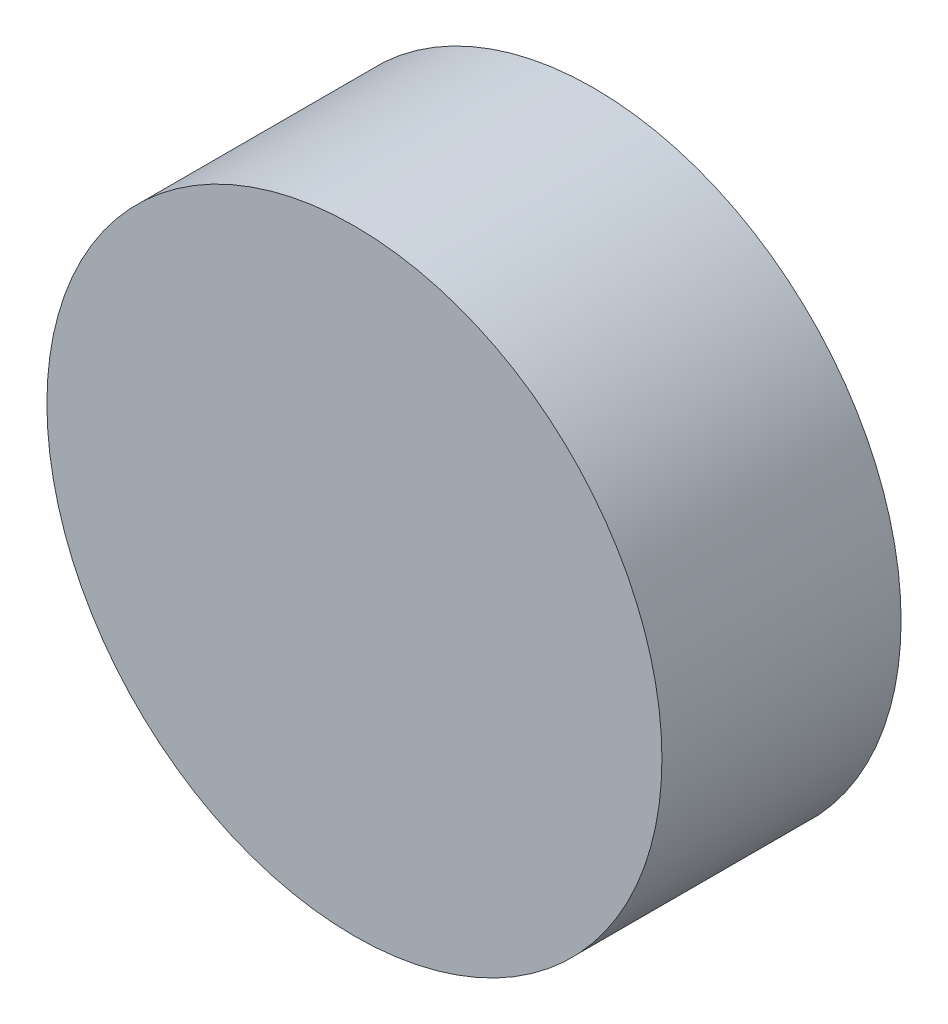
ISO-10303-21;
HEADER;
FILE_DESCRIPTION(('STEP AP214'),'2;1');
FILE_NAME('part.step','',(''),(''),'','','');
FILE_SCHEMA(('AUTOMOTIVE_DESIGN { 1 0 10303 214 1 1 1 1 }'));
ENDSEC;
DATA;
#1=APPLICATION_CONTEXT('core data for automotive mechanical design processes');
#2=APPLICATION_PROTOCOL_DEFINITION('international standard','automotive_design',2000,#1);
#3=PRODUCT_CONTEXT('',#1,'mechanical');
#4=PRODUCT('Part','Part','',(#3));
#5=PRODUCT_RELATED_PRODUCT_CATEGORY('part','',(#4));
#6=PRODUCT_DEFINITION_FORMATION('','',#4);
#7=PRODUCT_DEFINITION_CONTEXT('part definition',#1,'design');
#8=PRODUCT_DEFINITION('design','',#6,#7);
#9=PRODUCT_DEFINITION_SHAPE('','',#8);
#10=(LENGTH_UNIT() NAMED_UNIT(*) SI_UNIT(.MILLI.,.METRE.));
#11=(NAMED_UNIT(*) PLANE_ANGLE_UNIT() SI_UNIT($,.RADIAN.));
#12=(NAMED_UNIT(*) SI_UNIT($,.STERADIAN.) SOLID_ANGLE_UNIT());
#13=UNCERTAINTY_MEASURE_WITH_UNIT(LENGTH_MEASURE(1.E-05),#10,'distance_accuracy_value','');
#14=(GEOMETRIC_REPRESENTATION_CONTEXT(3) GLOBAL_UNCERTAINTY_ASSIGNED_CONTEXT((#13)) GLOBAL_UNIT_ASSIGNED_CONTEXT((#10,
#11,#12)) REPRESENTATION_CONTEXT('',''));
#15=CARTESIAN_POINT('',(0.,0.,0.));
#16=DIRECTION('',(0.,0.,1.));
#17=DIRECTION('',(1.,0.,0.));
#18=AXIS2_PLACEMENT_3D('',#15,#16,#17);
#19=CARTESIAN_POINT('',(-14.1464842919036,25.0616063254266,7.));
#20=DIRECTION('',(0.,0.,-1.));
#21=DIRECTION('',(-1.,0.,0.));
#22=AXIS2_PLACEMENT_3D('',#19,#20,#21);
#23=CYLINDRICAL_SURFACE('',#22,9.);
#24=CARTESIAN_POINT('',(-14.1464842919036,25.0616063254266,7.));
#25=DIRECTION('',(0.,0.,1.));
#26=DIRECTION('',(1.,0.,0.));
#27=AXIS2_PLACEMENT_3D('',#24,#25,#26);
#28=CIRCLE('',#27,9.);
#29=CARTESIAN_POINT('',(-5.14648429190357,25.0616063254266,7.));
#30=VERTEX_POINT('',#29);
#31=EDGE_CURVE('E10',#30,#30,#28,.T.);
#32=ORIENTED_EDGE('',*,*,#31,.F.);
#33=EDGE_LOOP('',(#32));
#34=FACE_BOUND('',#33,.T.);
#35=CARTESIAN_POINT('',(-14.1464842919036,25.0616063254266,0.));
#36=DIRECTION('',(0.,0.,1.));
#37=DIRECTION('',(1.,0.,0.));
#38=AXIS2_PLACEMENT_3D('',#35,#36,#37);
#39=CIRCLE('',#38,9.);
#40=CARTESIAN_POINT('',(-5.14648429190357,25.0616063254266,0.));
#41=VERTEX_POINT('',#40);
#42=EDGE_CURVE('E40',#41,#41,#39,.T.);
#43=ORIENTED_EDGE('',*,*,#42,.T.);
#44=EDGE_LOOP('',(#43));
#45=FACE_BOUND('',#44,.T.);
#46=ADVANCED_FACE('F37',(#34,#45),#23,.T.);
#47=CARTESIAN_POINT('',(-14.1464842919036,25.0616063254266,7.));
#48=DIRECTION('',(0.,0.,1.));
#49=DIRECTION('',(1.,0.,0.));
#50=AXIS2_PLACEMENT_3D('',#47,#48,#49);
#51=PLANE('',#50);
#52=ORIENTED_EDGE('',*,*,#31,.T.);
#53=EDGE_LOOP('',(#52));
#54=FACE_BOUND('',#53,.T.);
#55=ADVANCED_FACE('F52',(#54),#51,.T.);
#56=CARTESIAN_POINT('',(-14.1464842919036,25.0616063254266,0.));
#57=DIRECTION('',(0.,0.,1.));
#58=DIRECTION('',(1.,0.,0.));
#59=AXIS2_PLACEMENT_3D('',#56,#57,#58);
#60=PLANE('',#59);
#61=ORIENTED_EDGE('',*,*,#42,.F.);
#62=EDGE_LOOP('',(#61));
#63=FACE_BOUND('',#62,.T.);
#64=ADVANCED_FACE('F50',(#63),#60,.F.);
#65=CLOSED_SHELL('',(#46,#55,#64));
#66=MANIFOLD_SOLID_BREP('B2',#65);
#67=ADVANCED_BREP_SHAPE_REPRESENTATION('',(#18,#66),#14);
#68=SHAPE_DEFINITION_REPRESENTATION(#9,#67);
ENDSEC;
END-ISO-10303-21;
